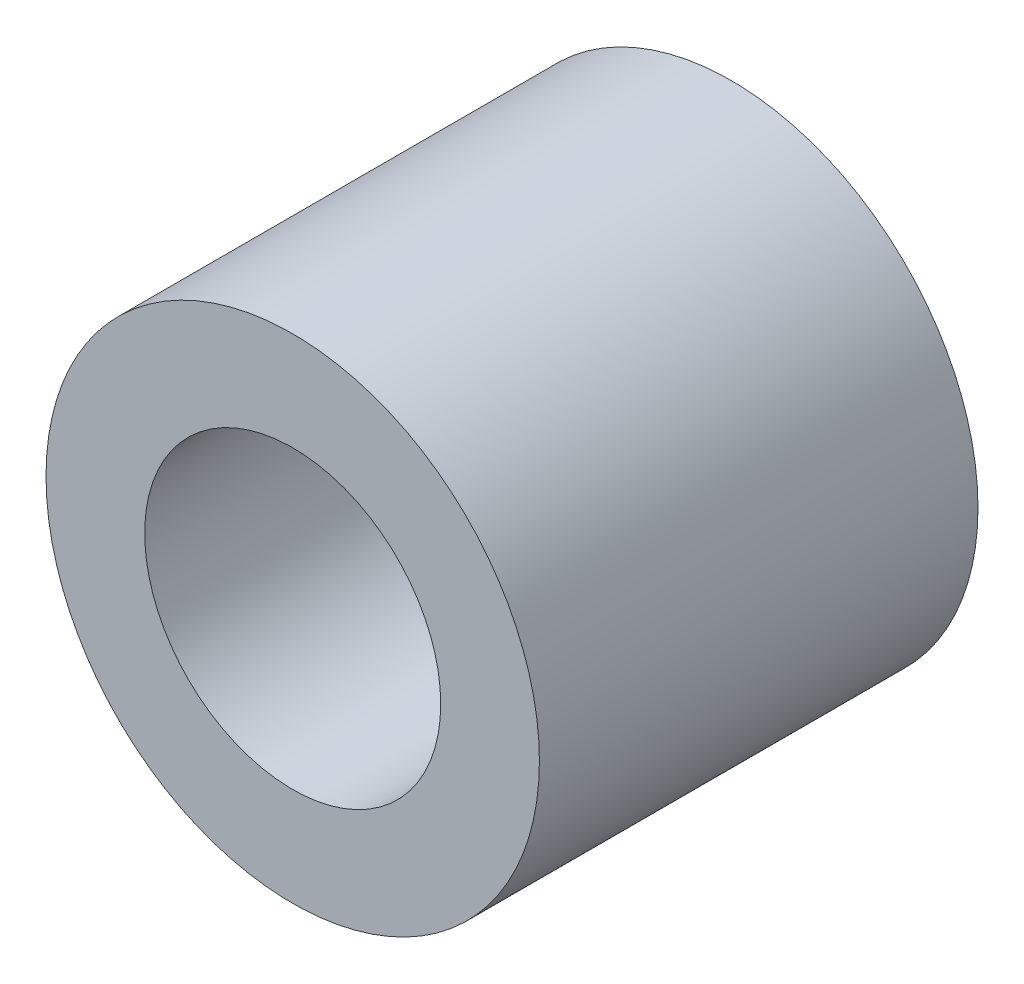
ISO-10303-21;
HEADER;
FILE_DESCRIPTION(('STEP AP214'),'2;1');
FILE_NAME('part.step','',(''),(''),'','','');
FILE_SCHEMA(('AUTOMOTIVE_DESIGN { 1 0 10303 214 1 1 1 1 }'));
ENDSEC;
DATA;
#1=APPLICATION_CONTEXT('core data for automotive mechanical design processes');
#2=APPLICATION_PROTOCOL_DEFINITION('international standard','automotive_design',2000,#1);
#3=PRODUCT_CONTEXT('',#1,'mechanical');
#4=PRODUCT('Part','Part','',(#3));
#5=PRODUCT_RELATED_PRODUCT_CATEGORY('part','',(#4));
#6=PRODUCT_DEFINITION_FORMATION('','',#4);
#7=PRODUCT_DEFINITION_CONTEXT('part definition',#1,'design');
#8=PRODUCT_DEFINITION('design','',#6,#7);
#9=PRODUCT_DEFINITION_SHAPE('','',#8);
#10=(LENGTH_UNIT() NAMED_UNIT(*) SI_UNIT(.MILLI.,.METRE.));
#11=(NAMED_UNIT(*) PLANE_ANGLE_UNIT() SI_UNIT($,.RADIAN.));
#12=(NAMED_UNIT(*) SI_UNIT($,.STERADIAN.) SOLID_ANGLE_UNIT());
#13=UNCERTAINTY_MEASURE_WITH_UNIT(LENGTH_MEASURE(1.E-05),#10,'distance_accuracy_value','');
#14=(GEOMETRIC_REPRESENTATION_CONTEXT(3) GLOBAL_UNCERTAINTY_ASSIGNED_CONTEXT((#13)) GLOBAL_UNIT_ASSIGNED_CONTEXT((#10,
#11,#12)) REPRESENTATION_CONTEXT('',''));
#15=CARTESIAN_POINT('',(0.,0.,0.));
#16=DIRECTION('',(0.,0.,1.));
#17=DIRECTION('',(1.,0.,0.));
#18=AXIS2_PLACEMENT_3D('',#15,#16,#17);
#19=CARTESIAN_POINT('',(0.,0.,2.));
#20=DIRECTION('',(0.,0.,1.));
#21=DIRECTION('',(1.,0.,0.));
#22=AXIS2_PLACEMENT_3D('',#19,#20,#21);
#23=PLANE('',#22);
#24=CARTESIAN_POINT('',(0.,0.,2.));
#25=DIRECTION('',(0.,0.,1.));
#26=DIRECTION('',(1.,0.,0.));
#27=AXIS2_PLACEMENT_3D('',#24,#25,#26);
#28=CIRCLE('',#27,2.25);
#29=CARTESIAN_POINT('',(2.25,0.,2.));
#30=VERTEX_POINT('',#29);
#31=EDGE_CURVE('E10',#30,#30,#28,.T.);
#32=ORIENTED_EDGE('',*,*,#31,.T.);
#33=EDGE_LOOP('',(#32));
#34=FACE_BOUND('',#33,.T.);
#35=CARTESIAN_POINT('',(0.,0.,2.));
#36=DIRECTION('',(0.,0.,1.));
#37=DIRECTION('',(1.,0.,0.));
#38=AXIS2_PLACEMENT_3D('',#35,#36,#37);
#39=CIRCLE('',#38,1.35);
#40=CARTESIAN_POINT('',(1.35,0.,2.));
#41=VERTEX_POINT('',#40);
#42=EDGE_CURVE('E41',#41,#41,#39,.T.);
#43=ORIENTED_EDGE('',*,*,#42,.F.);
#44=EDGE_LOOP('',(#43));
#45=FACE_BOUND('',#44,.T.);
#46=ADVANCED_FACE('F30',(#34,#45),#23,.T.);
#47=CARTESIAN_POINT('',(0.,0.,-2.));
#48=DIRECTION('',(0.,0.,1.));
#49=DIRECTION('',(1.,0.,0.));
#50=AXIS2_PLACEMENT_3D('',#47,#48,#49);
#51=PLANE('',#50);
#52=CARTESIAN_POINT('',(0.,0.,-2.));
#53=DIRECTION('',(0.,0.,1.));
#54=DIRECTION('',(1.,0.,0.));
#55=AXIS2_PLACEMENT_3D('',#52,#53,#54);
#56=CIRCLE('',#55,2.25);
#57=CARTESIAN_POINT('',(2.25,0.,-2.));
#58=VERTEX_POINT('',#57);
#59=EDGE_CURVE('E34',#58,#58,#56,.T.);
#60=ORIENTED_EDGE('',*,*,#59,.F.);
#61=EDGE_LOOP('',(#60));
#62=FACE_BOUND('',#61,.T.);
#63=CARTESIAN_POINT('',(0.,0.,-2.));
#64=DIRECTION('',(0.,0.,1.));
#65=DIRECTION('',(1.,0.,0.));
#66=AXIS2_PLACEMENT_3D('',#63,#64,#65);
#67=CIRCLE('',#66,1.35);
#68=CARTESIAN_POINT('',(1.35,0.,-2.));
#69=VERTEX_POINT('',#68);
#70=EDGE_CURVE('E43',#69,#69,#67,.T.);
#71=ORIENTED_EDGE('',*,*,#70,.T.);
#72=EDGE_LOOP('',(#71));
#73=FACE_BOUND('',#72,.T.);
#74=ADVANCED_FACE('F53',(#62,#73),#51,.F.);
#75=CARTESIAN_POINT('',(0.,0.,2.));
#76=DIRECTION('',(0.,0.,-1.));
#77=DIRECTION('',(-1.,0.,0.));
#78=AXIS2_PLACEMENT_3D('',#75,#76,#77);
#79=CYLINDRICAL_SURFACE('',#78,2.25);
#80=ORIENTED_EDGE('',*,*,#31,.F.);
#81=EDGE_LOOP('',(#80));
#82=FACE_BOUND('',#81,.T.);
#83=ORIENTED_EDGE('',*,*,#59,.T.);
#84=EDGE_LOOP('',(#83));
#85=FACE_BOUND('',#84,.T.);
#86=ADVANCED_FACE('F32',(#82,#85),#79,.T.);
#87=CARTESIAN_POINT('',(0.,0.,2.));
#88=DIRECTION('',(0.,0.,-1.));
#89=DIRECTION('',(-1.,0.,0.));
#90=AXIS2_PLACEMENT_3D('',#87,#88,#89);
#91=CYLINDRICAL_SURFACE('',#90,1.35);
#92=ORIENTED_EDGE('',*,*,#42,.T.);
#93=EDGE_LOOP('',(#92));
#94=FACE_BOUND('',#93,.T.);
#95=ORIENTED_EDGE('',*,*,#70,.F.);
#96=EDGE_LOOP('',(#95));
#97=FACE_BOUND('',#96,.T.);
#98=ADVANCED_FACE('F49',(#94,#97),#91,.F.);
#99=CLOSED_SHELL('',(#46,#74,#86,#98));
#100=MANIFOLD_SOLID_BREP('B2',#99);
#101=ADVANCED_BREP_SHAPE_REPRESENTATION('',(#18,#100),#14);
#102=SHAPE_DEFINITION_REPRESENTATION(#9,#101);
ENDSEC;
END-ISO-10303-21;
